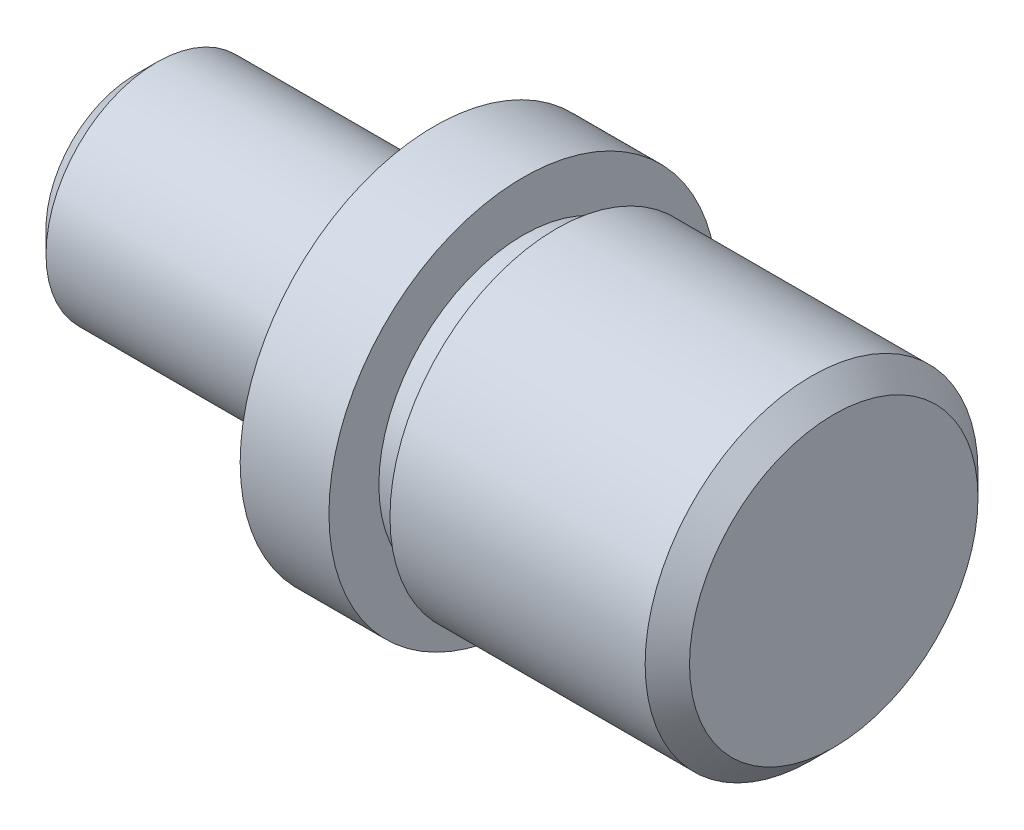
ISO-10303-21;
HEADER;
FILE_DESCRIPTION(('STEP AP214'),'2;1');
FILE_NAME('part.step','',(''),(''),'','','');
FILE_SCHEMA(('AUTOMOTIVE_DESIGN { 1 0 10303 214 1 1 1 1 }'));
ENDSEC;
DATA;
#1=APPLICATION_CONTEXT('core data for automotive mechanical design processes');
#2=APPLICATION_PROTOCOL_DEFINITION('international standard','automotive_design',2000,#1);
#3=PRODUCT_CONTEXT('',#1,'mechanical');
#4=PRODUCT('Part','Part','',(#3));
#5=PRODUCT_RELATED_PRODUCT_CATEGORY('part','',(#4));
#6=PRODUCT_DEFINITION_FORMATION('','',#4);
#7=PRODUCT_DEFINITION_CONTEXT('part definition',#1,'design');
#8=PRODUCT_DEFINITION('design','',#6,#7);
#9=PRODUCT_DEFINITION_SHAPE('','',#8);
#10=(LENGTH_UNIT() NAMED_UNIT(*) SI_UNIT(.MILLI.,.METRE.));
#11=(NAMED_UNIT(*) PLANE_ANGLE_UNIT() SI_UNIT($,.RADIAN.));
#12=(NAMED_UNIT(*) SI_UNIT($,.STERADIAN.) SOLID_ANGLE_UNIT());
#13=UNCERTAINTY_MEASURE_WITH_UNIT(LENGTH_MEASURE(1.E-05),#10,'distance_accuracy_value','');
#14=(GEOMETRIC_REPRESENTATION_CONTEXT(3) GLOBAL_UNCERTAINTY_ASSIGNED_CONTEXT((#13)) GLOBAL_UNIT_ASSIGNED_CONTEXT((#10,
#11,#12)) REPRESENTATION_CONTEXT('',''));
#15=CARTESIAN_POINT('',(0.,0.,0.));
#16=DIRECTION('',(0.,0.,1.));
#17=DIRECTION('',(1.,0.,0.));
#18=AXIS2_PLACEMENT_3D('',#15,#16,#17);
#19=CARTESIAN_POINT('',(0.,0.,0.));
#20=DIRECTION('',(1.,0.,0.));
#21=DIRECTION('',(0.,0.,-1.));
#22=AXIS2_PLACEMENT_3D('',#19,#20,#21);
#23=PLANE('',#22);
#24=CARTESIAN_POINT('',(0.,0.,0.));
#25=DIRECTION('',(1.,0.,0.));
#26=DIRECTION('',(0.,0.,-1.));
#27=AXIS2_PLACEMENT_3D('',#24,#25,#26);
#28=CIRCLE('',#27,8.);
#29=CARTESIAN_POINT('',(0.,0.,-8.));
#30=VERTEX_POINT('',#29);
#31=EDGE_CURVE('E40',#30,#30,#28,.F.);
#32=ORIENTED_EDGE('',*,*,#31,.T.);
#33=EDGE_LOOP('',(#32));
#34=FACE_BOUND('',#33,.T.);
#35=ADVANCED_FACE('F33',(#34),#23,.F.);
#36=CARTESIAN_POINT('',(-82.8442888882929,0.,0.));
#37=DIRECTION('',(-1.,0.,0.));
#38=DIRECTION('',(0.,0.,1.));
#39=AXIS2_PLACEMENT_3D('',#36,#37,#38);
#40=CYLINDRICAL_SURFACE('',#39,9.99999999999998);
#41=CARTESIAN_POINT('',(1.99999999999999,0.,0.));
#42=DIRECTION('',(1.,0.,0.));
#43=DIRECTION('',(0.,0.,-1.));
#44=AXIS2_PLACEMENT_3D('',#41,#42,#43);
#45=CIRCLE('',#44,9.99999999999998);
#46=CARTESIAN_POINT('',(1.99999999999999,0.,-9.99999999999998));
#47=VERTEX_POINT('',#46);
#48=EDGE_CURVE('E10',#47,#47,#45,.T.);
#49=ORIENTED_EDGE('',*,*,#48,.T.);
#50=EDGE_LOOP('',(#49));
#51=FACE_BOUND('',#50,.T.);
#52=CARTESIAN_POINT('',(25.,0.,0.));
#53=DIRECTION('',(-1.,0.,0.));
#54=DIRECTION('',(0.,0.,1.));
#55=AXIS2_PLACEMENT_3D('',#52,#53,#54);
#56=CIRCLE('',#55,9.99999999999998);
#57=CARTESIAN_POINT('',(25.,0.,9.99999999999998));
#58=VERTEX_POINT('',#57);
#59=EDGE_CURVE('E53',#58,#58,#56,.T.);
#60=ORIENTED_EDGE('',*,*,#59,.T.);
#61=EDGE_LOOP('',(#60));
#62=FACE_BOUND('',#61,.T.);
#63=ADVANCED_FACE('F96',(#51,#62),#40,.T.);
#64=CARTESIAN_POINT('',(25.,9.99999999999998,0.));
#65=DIRECTION('',(-1.,0.,0.));
#66=DIRECTION('',(0.,0.,1.));
#67=AXIS2_PLACEMENT_3D('',#64,#65,#66);
#68=PLANE('',#67);
#69=ORIENTED_EDGE('',*,*,#59,.F.);
#70=EDGE_LOOP('',(#69));
#71=FACE_BOUND('',#70,.T.);
#72=CARTESIAN_POINT('',(25.,0.,0.));
#73=DIRECTION('',(-1.,0.,0.));
#74=DIRECTION('',(0.,0.,1.));
#75=AXIS2_PLACEMENT_3D('',#72,#73,#74);
#76=CIRCLE('',#75,7.99999999999998);
#77=CARTESIAN_POINT('',(25.,0.,7.99999999999998));
#78=VERTEX_POINT('',#77);
#79=EDGE_CURVE('E56',#78,#78,#76,.T.);
#80=ORIENTED_EDGE('',*,*,#79,.T.);
#81=EDGE_LOOP('',(#80));
#82=FACE_BOUND('',#81,.T.);
#83=ADVANCED_FACE('F101',(#71,#82),#68,.F.);
#84=CARTESIAN_POINT('',(-82.8442888882929,0.,0.));
#85=DIRECTION('',(-1.,0.,0.));
#86=DIRECTION('',(0.,0.,1.));
#87=AXIS2_PLACEMENT_3D('',#84,#85,#86);
#88=CYLINDRICAL_SURFACE('',#87,7.99999999999997);
#89=ORIENTED_EDGE('',*,*,#79,.F.);
#90=EDGE_LOOP('',(#89));
#91=FACE_BOUND('',#90,.T.);
#92=CARTESIAN_POINT('',(27.,0.,0.));
#93=DIRECTION('',(-1.,0.,0.));
#94=DIRECTION('',(0.,0.,1.));
#95=AXIS2_PLACEMENT_3D('',#92,#93,#94);
#96=CIRCLE('',#95,7.99999999999996);
#97=CARTESIAN_POINT('',(27.,0.,7.99999999999996));
#98=VERTEX_POINT('',#97);
#99=EDGE_CURVE('E59',#98,#98,#96,.T.);
#100=ORIENTED_EDGE('',*,*,#99,.T.);
#101=EDGE_LOOP('',(#100));
#102=FACE_BOUND('',#101,.T.);
#103=ADVANCED_FACE('F187',(#91,#102),#88,.T.);
#104=CARTESIAN_POINT('',(27.,7.99999999999996,0.));
#105=DIRECTION('',(1.,0.,0.));
#106=DIRECTION('',(0.,0.,-1.));
#107=AXIS2_PLACEMENT_3D('',#104,#105,#106);
#108=PLANE('',#107);
#109=ORIENTED_EDGE('',*,*,#99,.F.);
#110=EDGE_LOOP('',(#109));
#111=FACE_BOUND('',#110,.T.);
#112=CARTESIAN_POINT('',(27.,0.,0.));
#113=DIRECTION('',(-1.,0.,0.));
#114=DIRECTION('',(0.,0.,1.));
#115=AXIS2_PLACEMENT_3D('',#112,#113,#114);
#116=CIRCLE('',#115,17.5);
#117=CARTESIAN_POINT('',(27.,0.,17.5));
#118=VERTEX_POINT('',#117);
#119=EDGE_CURVE('E62',#118,#118,#116,.T.);
#120=ORIENTED_EDGE('',*,*,#119,.T.);
#121=EDGE_LOOP('',(#120));
#122=FACE_BOUND('',#121,.T.);
#123=ADVANCED_FACE('F177',(#111,#122),#108,.F.);
#124=CARTESIAN_POINT('',(-82.8442888882929,0.,0.));
#125=DIRECTION('',(-1.,0.,0.));
#126=DIRECTION('',(0.,0.,1.));
#127=AXIS2_PLACEMENT_3D('',#124,#125,#126);
#128=CYLINDRICAL_SURFACE('',#127,17.5);
#129=ORIENTED_EDGE('',*,*,#119,.F.);
#130=EDGE_LOOP('',(#129));
#131=FACE_BOUND('',#130,.T.);
#132=CARTESIAN_POINT('',(35.,0.,0.));
#133=DIRECTION('',(-1.,0.,0.));
#134=DIRECTION('',(0.,0.,1.));
#135=AXIS2_PLACEMENT_3D('',#132,#133,#134);
#136=CIRCLE('',#135,17.5);
#137=CARTESIAN_POINT('',(35.,0.,17.5));
#138=VERTEX_POINT('',#137);
#139=EDGE_CURVE('E65',#138,#138,#136,.T.);
#140=ORIENTED_EDGE('',*,*,#139,.T.);
#141=EDGE_LOOP('',(#140));
#142=FACE_BOUND('',#141,.T.);
#143=ADVANCED_FACE('F167',(#131,#142),#128,.T.);
#144=CARTESIAN_POINT('',(35.,17.5,0.));
#145=DIRECTION('',(-1.,0.,0.));
#146=DIRECTION('',(0.,0.,1.));
#147=AXIS2_PLACEMENT_3D('',#144,#145,#146);
#148=PLANE('',#147);
#149=ORIENTED_EDGE('',*,*,#139,.F.);
#150=EDGE_LOOP('',(#149));
#151=FACE_BOUND('',#150,.T.);
#152=CARTESIAN_POINT('',(35.,0.,0.));
#153=DIRECTION('',(-1.,0.,0.));
#154=DIRECTION('',(0.,0.,1.));
#155=AXIS2_PLACEMENT_3D('',#152,#153,#154);
#156=CIRCLE('',#155,13.);
#157=CARTESIAN_POINT('',(35.,0.,13.));
#158=VERTEX_POINT('',#157);
#159=EDGE_CURVE('E68',#158,#158,#156,.T.);
#160=ORIENTED_EDGE('',*,*,#159,.T.);
#161=EDGE_LOOP('',(#160));
#162=FACE_BOUND('',#161,.T.);
#163=ADVANCED_FACE('F157',(#151,#162),#148,.F.);
#164=CARTESIAN_POINT('',(-82.8442888882929,0.,0.));
#165=DIRECTION('',(-1.,0.,0.));
#166=DIRECTION('',(0.,0.,1.));
#167=AXIS2_PLACEMENT_3D('',#164,#165,#166);
#168=CYLINDRICAL_SURFACE('',#167,13.);
#169=ORIENTED_EDGE('',*,*,#159,.F.);
#170=EDGE_LOOP('',(#169));
#171=FACE_BOUND('',#170,.T.);
#172=CARTESIAN_POINT('',(38.,0.,0.));
#173=DIRECTION('',(-1.,0.,0.));
#174=DIRECTION('',(0.,0.,1.));
#175=AXIS2_PLACEMENT_3D('',#172,#173,#174);
#176=CIRCLE('',#175,13.);
#177=CARTESIAN_POINT('',(38.,0.,13.));
#178=VERTEX_POINT('',#177);
#179=EDGE_CURVE('E71',#178,#178,#176,.T.);
#180=ORIENTED_EDGE('',*,*,#179,.T.);
#181=EDGE_LOOP('',(#180));
#182=FACE_BOUND('',#181,.T.);
#183=ADVANCED_FACE('F92',(#171,#182),#168,.T.);
#184=CARTESIAN_POINT('',(38.,13.,0.));
#185=DIRECTION('',(1.,0.,0.));
#186=DIRECTION('',(0.,0.,-1.));
#187=AXIS2_PLACEMENT_3D('',#184,#185,#186);
#188=PLANE('',#187);
#189=ORIENTED_EDGE('',*,*,#179,.F.);
#190=EDGE_LOOP('',(#189));
#191=FACE_BOUND('',#190,.T.);
#192=CARTESIAN_POINT('',(38.,0.,0.));
#193=DIRECTION('',(-1.,0.,0.));
#194=DIRECTION('',(0.,0.,1.));
#195=AXIS2_PLACEMENT_3D('',#192,#193,#194);
#196=CIRCLE('',#195,15.);
#197=CARTESIAN_POINT('',(38.,0.,15.));
#198=VERTEX_POINT('',#197);
#199=EDGE_CURVE('E74',#198,#198,#196,.T.);
#200=ORIENTED_EDGE('',*,*,#199,.T.);
#201=EDGE_LOOP('',(#200));
#202=FACE_BOUND('',#201,.T.);
#203=ADVANCED_FACE('F78',(#191,#202),#188,.F.);
#204=CARTESIAN_POINT('',(-82.8442888882929,0.,0.));
#205=DIRECTION('',(-1.,0.,0.));
#206=DIRECTION('',(0.,0.,1.));
#207=AXIS2_PLACEMENT_3D('',#204,#205,#206);
#208=CYLINDRICAL_SURFACE('',#207,15.);
#209=CARTESIAN_POINT('',(61.,0.,0.));
#210=DIRECTION('',(-1.,0.,0.));
#211=DIRECTION('',(0.,0.,1.));
#212=AXIS2_PLACEMENT_3D('',#209,#210,#211);
#213=CIRCLE('',#212,15.);
#214=CARTESIAN_POINT('',(61.,0.,15.));
#215=VERTEX_POINT('',#214);
#216=EDGE_CURVE('E48',#215,#215,#213,.T.);
#217=ORIENTED_EDGE('',*,*,#216,.T.);
#218=EDGE_LOOP('',(#217));
#219=FACE_BOUND('',#218,.T.);
#220=ORIENTED_EDGE('',*,*,#199,.F.);
#221=EDGE_LOOP('',(#220));
#222=FACE_BOUND('',#221,.T.);
#223=ADVANCED_FACE('F80',(#219,#222),#208,.T.);
#224=CARTESIAN_POINT('',(63.,15.,0.));
#225=DIRECTION('',(-1.,0.,0.));
#226=DIRECTION('',(0.,0.,1.));
#227=AXIS2_PLACEMENT_3D('',#224,#225,#226);
#228=PLANE('',#227);
#229=CARTESIAN_POINT('',(63.,0.,0.));
#230=DIRECTION('',(-1.,0.,0.));
#231=DIRECTION('',(0.,0.,1.));
#232=AXIS2_PLACEMENT_3D('',#229,#230,#231);
#233=CIRCLE('',#232,13.);
#234=CARTESIAN_POINT('',(63.,0.,13.));
#235=VERTEX_POINT('',#234);
#236=EDGE_CURVE('E44',#235,#235,#233,.F.);
#237=ORIENTED_EDGE('',*,*,#236,.T.);
#238=EDGE_LOOP('',(#237));
#239=FACE_BOUND('',#238,.T.);
#240=ADVANCED_FACE('F82',(#239),#228,.F.);
#241=CARTESIAN_POINT('',(61.,0.,0.));
#242=DIRECTION('',(-1.,0.,0.));
#243=DIRECTION('',(0.,0.,1.));
#244=AXIS2_PLACEMENT_3D('',#241,#242,#243);
#245=CONICAL_SURFACE('',#244,15.,0.785398163397458);
#246=ORIENTED_EDGE('',*,*,#236,.F.);
#247=EDGE_LOOP('',(#246));
#248=FACE_BOUND('',#247,.T.);
#249=ORIENTED_EDGE('',*,*,#216,.F.);
#250=EDGE_LOOP('',(#249));
#251=FACE_BOUND('',#250,.T.);
#252=ADVANCED_FACE('F89',(#248,#251),#245,.T.);
#253=CARTESIAN_POINT('',(0.,0.,0.));
#254=DIRECTION('',(1.,0.,0.));
#255=DIRECTION('',(0.,0.,-1.));
#256=AXIS2_PLACEMENT_3D('',#253,#254,#255);
#257=CONICAL_SURFACE('',#256,8.,0.785398163397447);
#258=ORIENTED_EDGE('',*,*,#48,.F.);
#259=EDGE_LOOP('',(#258));
#260=FACE_BOUND('',#259,.T.);
#261=ORIENTED_EDGE('',*,*,#31,.F.);
#262=EDGE_LOOP('',(#261));
#263=FACE_BOUND('',#262,.T.);
#264=ADVANCED_FACE('F35',(#260,#263),#257,.T.);
#265=CLOSED_SHELL('',(#35,#63,#83,#103,#123,#143,#163,#183,#203,#223,#240,#252,#264));
#266=MANIFOLD_SOLID_BREP('B2',#265);
#267=ADVANCED_BREP_SHAPE_REPRESENTATION('',(#18,#266),#14);
#268=SHAPE_DEFINITION_REPRESENTATION(#9,#267);
ENDSEC;
END-ISO-10303-21;
